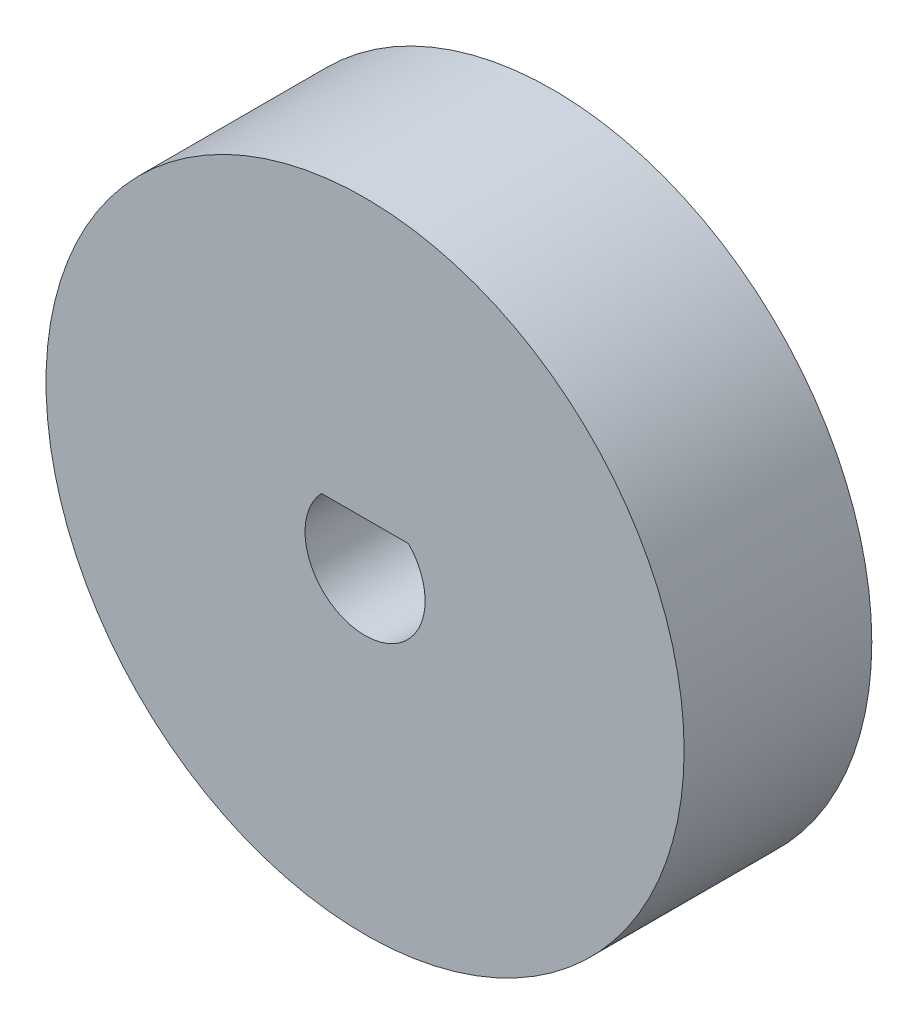
ISO-10303-21;
HEADER;
FILE_DESCRIPTION(('STEP AP214'),'2;1');
FILE_NAME('part.step','',(''),(''),'','','');
FILE_SCHEMA(('AUTOMOTIVE_DESIGN { 1 0 10303 214 1 1 1 1 }'));
ENDSEC;
DATA;
#1=APPLICATION_CONTEXT('core data for automotive mechanical design processes');
#2=APPLICATION_PROTOCOL_DEFINITION('international standard','automotive_design',2000,#1);
#3=PRODUCT_CONTEXT('',#1,'mechanical');
#4=PRODUCT('Part','Part','',(#3));
#5=PRODUCT_RELATED_PRODUCT_CATEGORY('part','',(#4));
#6=PRODUCT_DEFINITION_FORMATION('','',#4);
#7=PRODUCT_DEFINITION_CONTEXT('part definition',#1,'design');
#8=PRODUCT_DEFINITION('design','',#6,#7);
#9=PRODUCT_DEFINITION_SHAPE('','',#8);
#10=(LENGTH_UNIT() NAMED_UNIT(*) SI_UNIT(.MILLI.,.METRE.));
#11=(NAMED_UNIT(*) PLANE_ANGLE_UNIT() SI_UNIT($,.RADIAN.));
#12=(NAMED_UNIT(*) SI_UNIT($,.STERADIAN.) SOLID_ANGLE_UNIT());
#13=UNCERTAINTY_MEASURE_WITH_UNIT(LENGTH_MEASURE(1.E-05),#10,'distance_accuracy_value','');
#14=(GEOMETRIC_REPRESENTATION_CONTEXT(3) GLOBAL_UNCERTAINTY_ASSIGNED_CONTEXT((#13)) GLOBAL_UNIT_ASSIGNED_CONTEXT((#10,
#11,#12)) REPRESENTATION_CONTEXT('',''));
#15=CARTESIAN_POINT('',(0.,0.,0.));
#16=DIRECTION('',(0.,0.,1.));
#17=DIRECTION('',(1.,0.,0.));
#18=AXIS2_PLACEMENT_3D('',#15,#16,#17);
#19=CARTESIAN_POINT('',(14.,0.,3.00000000000001));
#20=DIRECTION('',(0.,0.,1.));
#21=DIRECTION('',(1.,0.,0.));
#22=AXIS2_PLACEMENT_3D('',#19,#20,#21);
#23=CYLINDRICAL_SURFACE('',#22,1.6);
#24=CARTESIAN_POINT('',(14.,0.,8.00000000000001));
#25=DIRECTION('',(0.,0.,1.));
#26=DIRECTION('',(1.,0.,0.));
#27=AXIS2_PLACEMENT_3D('',#24,#25,#26);
#28=CIRCLE('',#27,1.6);
#29=CARTESIAN_POINT('',(12.8381049961378,1.09999999999999,8.00000000000001));
#30=VERTEX_POINT('',#29);
#31=CARTESIAN_POINT('',(15.1618950038623,1.09999999999999,8.00000000000001));
#32=VERTEX_POINT('',#31);
#33=EDGE_CURVE('E68',#30,#32,#28,.T.);
#34=ORIENTED_EDGE('',*,*,#33,.T.);
#35=DIRECTION('',(0.,0.,1.));
#36=VECTOR('',#35,1.);
#37=CARTESIAN_POINT('',(15.1618950038623,1.09999999999999,3.00000000000001));
#38=LINE('',#37,#36);
#39=CARTESIAN_POINT('',(15.1618950038623,1.09999999999999,3.00000000000001));
#40=VERTEX_POINT('',#39);
#41=EDGE_CURVE('E11',#40,#32,#38,.T.);
#42=ORIENTED_EDGE('',*,*,#41,.F.);
#43=CARTESIAN_POINT('',(14.,0.,3.00000000000001));
#44=DIRECTION('',(0.,0.,1.));
#45=DIRECTION('',(1.,0.,0.));
#46=AXIS2_PLACEMENT_3D('',#43,#44,#45);
#47=CIRCLE('',#46,1.6);
#48=CARTESIAN_POINT('',(12.8381049961378,1.09999999999999,3.00000000000001));
#49=VERTEX_POINT('',#48);
#50=EDGE_CURVE('E52',#49,#40,#47,.T.);
#51=ORIENTED_EDGE('',*,*,#50,.F.);
#52=DIRECTION('',(0.,0.,1.));
#53=VECTOR('',#52,1.);
#54=CARTESIAN_POINT('',(12.8381049961378,1.09999999999999,3.00000000000001));
#55=LINE('',#54,#53);
#56=EDGE_CURVE('E40',#49,#30,#55,.T.);
#57=ORIENTED_EDGE('',*,*,#56,.T.);
#58=EDGE_LOOP('',(#34,#42,#51,#57));
#59=FACE_BOUND('',#58,.T.);
#60=ADVANCED_FACE('F37',(#59),#23,.F.);
#61=CARTESIAN_POINT('',(0.,1.09999999999999,3.00000000000001));
#62=DIRECTION('',(0.,-1.,0.));
#63=DIRECTION('',(0.,0.,-1.));
#64=AXIS2_PLACEMENT_3D('',#61,#62,#63);
#65=PLANE('',#64);
#66=DIRECTION('',(1.,0.,0.));
#67=VECTOR('',#66,1.);
#68=CARTESIAN_POINT('',(0.,1.09999999999999,8.00000000000001));
#69=LINE('',#68,#67);
#70=EDGE_CURVE('E66',#30,#32,#69,.T.);
#71=ORIENTED_EDGE('',*,*,#70,.F.);
#72=ORIENTED_EDGE('',*,*,#56,.F.);
#73=DIRECTION('',(1.,0.,0.));
#74=VECTOR('',#73,1.);
#75=CARTESIAN_POINT('',(0.,1.09999999999999,3.00000000000001));
#76=LINE('',#75,#74);
#77=EDGE_CURVE('E67',#49,#40,#76,.T.);
#78=ORIENTED_EDGE('',*,*,#77,.T.);
#79=ORIENTED_EDGE('',*,*,#41,.T.);
#80=EDGE_LOOP('',(#71,#72,#78,#79));
#81=FACE_BOUND('',#80,.T.);
#82=ADVANCED_FACE('F64',(#81),#65,.T.);
#83=CARTESIAN_POINT('',(14.,0.,3.00000000000001));
#84=DIRECTION('',(0.,0.,1.));
#85=DIRECTION('',(1.,0.,0.));
#86=AXIS2_PLACEMENT_3D('',#83,#84,#85);
#87=CYLINDRICAL_SURFACE('',#86,8.5);
#88=CARTESIAN_POINT('',(14.,0.,3.00000000000001));
#89=DIRECTION('',(0.,0.,1.));
#90=DIRECTION('',(1.,0.,0.));
#91=AXIS2_PLACEMENT_3D('',#88,#89,#90);
#92=CIRCLE('',#91,8.5);
#93=CARTESIAN_POINT('',(22.5,0.,3.00000000000001));
#94=VERTEX_POINT('',#93);
#95=EDGE_CURVE('E78',#94,#94,#92,.T.);
#96=ORIENTED_EDGE('',*,*,#95,.T.);
#97=EDGE_LOOP('',(#96));
#98=FACE_BOUND('',#97,.T.);
#99=CARTESIAN_POINT('',(14.,0.,8.00000000000001));
#100=DIRECTION('',(0.,0.,1.));
#101=DIRECTION('',(1.,0.,0.));
#102=AXIS2_PLACEMENT_3D('',#99,#100,#101);
#103=CIRCLE('',#102,8.5);
#104=CARTESIAN_POINT('',(22.5,0.,8.00000000000001));
#105=VERTEX_POINT('',#104);
#106=EDGE_CURVE('E73',#105,#105,#103,.T.);
#107=ORIENTED_EDGE('',*,*,#106,.F.);
#108=EDGE_LOOP('',(#107));
#109=FACE_BOUND('',#108,.T.);
#110=ADVANCED_FACE('F84',(#98,#109),#87,.T.);
#111=CARTESIAN_POINT('',(0.,0.,3.00000000000001));
#112=DIRECTION('',(0.,0.,1.));
#113=DIRECTION('',(1.,0.,0.));
#114=AXIS2_PLACEMENT_3D('',#111,#112,#113);
#115=PLANE('',#114);
#116=ORIENTED_EDGE('',*,*,#50,.T.);
#117=ORIENTED_EDGE('',*,*,#77,.F.);
#118=EDGE_LOOP('',(#116,#117));
#119=FACE_BOUND('',#118,.T.);
#120=ORIENTED_EDGE('',*,*,#95,.F.);
#121=EDGE_LOOP('',(#120));
#122=FACE_BOUND('',#121,.T.);
#123=ADVANCED_FACE('F87',(#119,#122),#115,.F.);
#124=CARTESIAN_POINT('',(0.,0.,8.00000000000001));
#125=DIRECTION('',(0.,0.,1.));
#126=DIRECTION('',(1.,0.,0.));
#127=AXIS2_PLACEMENT_3D('',#124,#125,#126);
#128=PLANE('',#127);
#129=ORIENTED_EDGE('',*,*,#33,.F.);
#130=ORIENTED_EDGE('',*,*,#70,.T.);
#131=EDGE_LOOP('',(#129,#130));
#132=FACE_BOUND('',#131,.T.);
#133=ORIENTED_EDGE('',*,*,#106,.T.);
#134=EDGE_LOOP('',(#133));
#135=FACE_BOUND('',#134,.T.);
#136=ADVANCED_FACE('F71',(#132,#135),#128,.T.);
#137=CLOSED_SHELL('',(#60,#82,#110,#123,#136));
#138=MANIFOLD_SOLID_BREP('B2',#137);
#139=ADVANCED_BREP_SHAPE_REPRESENTATION('',(#18,#138),#14);
#140=SHAPE_DEFINITION_REPRESENTATION(#9,#139);
ENDSEC;
END-ISO-10303-21;
